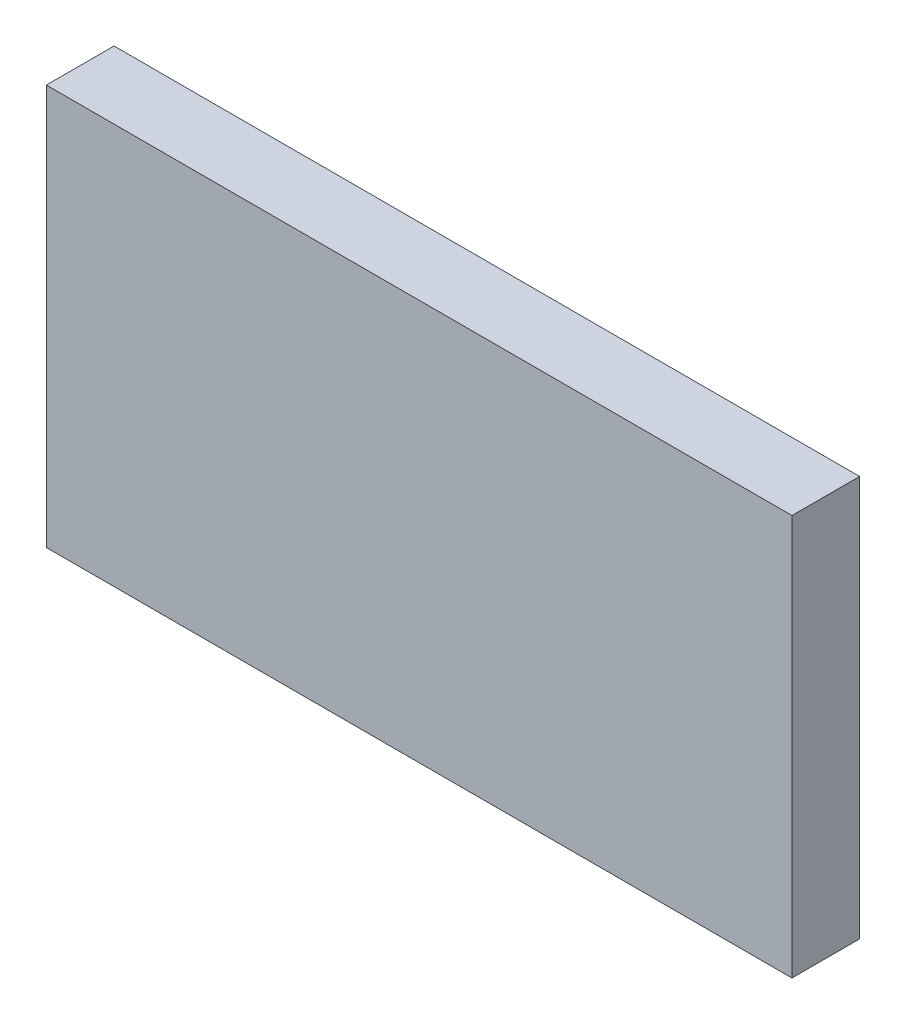
ISO-10303-21;
HEADER;
FILE_DESCRIPTION(('STEP AP214'),'2;1');
FILE_NAME('part.step','',(''),(''),'','','');
FILE_SCHEMA(('AUTOMOTIVE_DESIGN { 1 0 10303 214 1 1 1 1 }'));
ENDSEC;
DATA;
#1=APPLICATION_CONTEXT('core data for automotive mechanical design processes');
#2=APPLICATION_PROTOCOL_DEFINITION('international standard','automotive_design',2000,#1);
#3=PRODUCT_CONTEXT('',#1,'mechanical');
#4=PRODUCT('Part','Part','',(#3));
#5=PRODUCT_RELATED_PRODUCT_CATEGORY('part','',(#4));
#6=PRODUCT_DEFINITION_FORMATION('','',#4);
#7=PRODUCT_DEFINITION_CONTEXT('part definition',#1,'design');
#8=PRODUCT_DEFINITION('design','',#6,#7);
#9=PRODUCT_DEFINITION_SHAPE('','',#8);
#10=(LENGTH_UNIT() NAMED_UNIT(*) SI_UNIT(.MILLI.,.METRE.));
#11=(NAMED_UNIT(*) PLANE_ANGLE_UNIT() SI_UNIT($,.RADIAN.));
#12=(NAMED_UNIT(*) SI_UNIT($,.STERADIAN.) SOLID_ANGLE_UNIT());
#13=UNCERTAINTY_MEASURE_WITH_UNIT(LENGTH_MEASURE(1.E-05),#10,'distance_accuracy_value','');
#14=(GEOMETRIC_REPRESENTATION_CONTEXT(3) GLOBAL_UNCERTAINTY_ASSIGNED_CONTEXT((#13)) GLOBAL_UNIT_ASSIGNED_CONTEXT((#10,
#11,#12)) REPRESENTATION_CONTEXT('',''));
#15=CARTESIAN_POINT('',(0.,0.,0.));
#16=DIRECTION('',(0.,0.,1.));
#17=DIRECTION('',(1.,0.,0.));
#18=AXIS2_PLACEMENT_3D('',#15,#16,#17);
#19=CARTESIAN_POINT('',(-0.551,-2.221,0.));
#20=DIRECTION('',(1.,0.,0.));
#21=DIRECTION('',(0.,0.,1.));
#22=AXIS2_PLACEMENT_3D('',#19,#20,#21);
#23=PLANE('',#22);
#24=DIRECTION('',(0.,1.,0.));
#25=VECTOR('',#24,1.);
#26=CARTESIAN_POINT('',(-0.551,-2.221,0.1));
#27=LINE('',#26,#25);
#28=CARTESIAN_POINT('',(-0.551,-2.221,0.1));
#29=VERTEX_POINT('',#28);
#30=CARTESIAN_POINT('',(-0.551,-1.629,0.1));
#31=VERTEX_POINT('',#30);
#32=EDGE_CURVE('E11',#29,#31,#27,.T.);
#33=ORIENTED_EDGE('',*,*,#32,.T.);
#34=DIRECTION('',(0.,0.,1.));
#35=VECTOR('',#34,1.);
#36=CARTESIAN_POINT('',(-0.551,-1.629,0.));
#37=LINE('',#36,#35);
#38=CARTESIAN_POINT('',(-0.551,-1.629,0.));
#39=VERTEX_POINT('',#38);
#40=EDGE_CURVE('E24',#39,#31,#37,.T.);
#41=ORIENTED_EDGE('',*,*,#40,.F.);
#42=DIRECTION('',(0.,1.,0.));
#43=VECTOR('',#42,1.);
#44=CARTESIAN_POINT('',(-0.551,-2.221,0.));
#45=LINE('',#44,#43);
#46=CARTESIAN_POINT('',(-0.551,-2.221,0.));
#47=VERTEX_POINT('',#46);
#48=EDGE_CURVE('E86',#47,#39,#45,.T.);
#49=ORIENTED_EDGE('',*,*,#48,.F.);
#50=DIRECTION('',(0.,0.,1.));
#51=VECTOR('',#50,1.);
#52=CARTESIAN_POINT('',(-0.551,-2.221,0.));
#53=LINE('',#52,#51);
#54=EDGE_CURVE('E36',#47,#29,#53,.T.);
#55=ORIENTED_EDGE('',*,*,#54,.T.);
#56=EDGE_LOOP('',(#33,#41,#49,#55));
#57=FACE_BOUND('',#56,.T.);
#58=ADVANCED_FACE('F17',(#57),#23,.F.);
#59=CARTESIAN_POINT('',(0.551,-2.221,0.));
#60=DIRECTION('',(1.,0.,0.));
#61=DIRECTION('',(0.,0.,1.));
#62=AXIS2_PLACEMENT_3D('',#59,#60,#61);
#63=PLANE('',#62);
#64=DIRECTION('',(0.,0.,1.));
#65=VECTOR('',#64,1.);
#66=CARTESIAN_POINT('',(0.551,-2.221,0.));
#67=LINE('',#66,#65);
#68=CARTESIAN_POINT('',(0.551,-2.221,0.));
#69=VERTEX_POINT('',#68);
#70=CARTESIAN_POINT('',(0.551,-2.221,0.1));
#71=VERTEX_POINT('',#70);
#72=EDGE_CURVE('E83',#69,#71,#67,.T.);
#73=ORIENTED_EDGE('',*,*,#72,.F.);
#74=DIRECTION('',(0.,1.,0.));
#75=VECTOR('',#74,1.);
#76=CARTESIAN_POINT('',(0.551,-2.221,0.));
#77=LINE('',#76,#75);
#78=CARTESIAN_POINT('',(0.551,-1.629,0.));
#79=VERTEX_POINT('',#78);
#80=EDGE_CURVE('E63',#69,#79,#77,.T.);
#81=ORIENTED_EDGE('',*,*,#80,.T.);
#82=DIRECTION('',(0.,0.,1.));
#83=VECTOR('',#82,1.);
#84=CARTESIAN_POINT('',(0.551,-1.629,0.));
#85=LINE('',#84,#83);
#86=CARTESIAN_POINT('',(0.551,-1.629,0.1));
#87=VERTEX_POINT('',#86);
#88=EDGE_CURVE('E57',#79,#87,#85,.T.);
#89=ORIENTED_EDGE('',*,*,#88,.T.);
#90=DIRECTION('',(0.,1.,0.));
#91=VECTOR('',#90,1.);
#92=CARTESIAN_POINT('',(0.551,-2.221,0.1));
#93=LINE('',#92,#91);
#94=EDGE_CURVE('E60',#71,#87,#93,.T.);
#95=ORIENTED_EDGE('',*,*,#94,.F.);
#96=EDGE_LOOP('',(#73,#81,#89,#95));
#97=FACE_BOUND('',#96,.T.);
#98=ADVANCED_FACE('F59',(#97),#63,.T.);
#99=CARTESIAN_POINT('',(-0.551,-2.221,0.));
#100=DIRECTION('',(0.,1.,0.));
#101=DIRECTION('',(0.,0.,1.));
#102=AXIS2_PLACEMENT_3D('',#99,#100,#101);
#103=PLANE('',#102);
#104=ORIENTED_EDGE('',*,*,#72,.T.);
#105=DIRECTION('',(1.,0.,0.));
#106=VECTOR('',#105,1.);
#107=CARTESIAN_POINT('',(-0.551,-2.221,0.1));
#108=LINE('',#107,#106);
#109=EDGE_CURVE('E71',#29,#71,#108,.T.);
#110=ORIENTED_EDGE('',*,*,#109,.F.);
#111=ORIENTED_EDGE('',*,*,#54,.F.);
#112=DIRECTION('',(1.,0.,0.));
#113=VECTOR('',#112,1.);
#114=CARTESIAN_POINT('',(-0.551,-2.221,0.));
#115=LINE('',#114,#113);
#116=EDGE_CURVE('E76',#47,#69,#115,.T.);
#117=ORIENTED_EDGE('',*,*,#116,.T.);
#118=EDGE_LOOP('',(#104,#110,#111,#117));
#119=FACE_BOUND('',#118,.T.);
#120=ADVANCED_FACE('F91',(#119),#103,.F.);
#121=CARTESIAN_POINT('',(-0.551,-1.629,0.));
#122=DIRECTION('',(0.,1.,0.));
#123=DIRECTION('',(0.,0.,1.));
#124=AXIS2_PLACEMENT_3D('',#121,#122,#123);
#125=PLANE('',#124);
#126=DIRECTION('',(1.,0.,0.));
#127=VECTOR('',#126,1.);
#128=CARTESIAN_POINT('',(-0.551,-1.629,0.));
#129=LINE('',#128,#127);
#130=EDGE_CURVE('E74',#39,#79,#129,.T.);
#131=ORIENTED_EDGE('',*,*,#130,.F.);
#132=ORIENTED_EDGE('',*,*,#40,.T.);
#133=DIRECTION('',(1.,0.,0.));
#134=VECTOR('',#133,1.);
#135=CARTESIAN_POINT('',(-0.551,-1.629,0.1));
#136=LINE('',#135,#134);
#137=EDGE_CURVE('E69',#31,#87,#136,.T.);
#138=ORIENTED_EDGE('',*,*,#137,.T.);
#139=ORIENTED_EDGE('',*,*,#88,.F.);
#140=EDGE_LOOP('',(#131,#132,#138,#139));
#141=FACE_BOUND('',#140,.T.);
#142=ADVANCED_FACE('F73',(#141),#125,.T.);
#143=CARTESIAN_POINT('',(-0.551,-2.221,0.));
#144=DIRECTION('',(0.,0.,1.));
#145=DIRECTION('',(1.,0.,0.));
#146=AXIS2_PLACEMENT_3D('',#143,#144,#145);
#147=PLANE('',#146);
#148=ORIENTED_EDGE('',*,*,#130,.T.);
#149=ORIENTED_EDGE('',*,*,#80,.F.);
#150=ORIENTED_EDGE('',*,*,#116,.F.);
#151=ORIENTED_EDGE('',*,*,#48,.T.);
#152=EDGE_LOOP('',(#148,#149,#150,#151));
#153=FACE_BOUND('',#152,.T.);
#154=ADVANCED_FACE('F89',(#153),#147,.F.);
#155=CARTESIAN_POINT('',(-0.551,-2.221,0.1));
#156=DIRECTION('',(0.,0.,1.));
#157=DIRECTION('',(1.,0.,0.));
#158=AXIS2_PLACEMENT_3D('',#155,#156,#157);
#159=PLANE('',#158);
#160=ORIENTED_EDGE('',*,*,#32,.F.);
#161=ORIENTED_EDGE('',*,*,#109,.T.);
#162=ORIENTED_EDGE('',*,*,#94,.T.);
#163=ORIENTED_EDGE('',*,*,#137,.F.);
#164=EDGE_LOOP('',(#160,#161,#162,#163));
#165=FACE_BOUND('',#164,.T.);
#166=ADVANCED_FACE('F68',(#165),#159,.T.);
#167=CLOSED_SHELL('',(#58,#98,#120,#142,#154,#166));
#168=MANIFOLD_SOLID_BREP('B1',#167);
#169=ADVANCED_BREP_SHAPE_REPRESENTATION('',(#18,#168),#14);
#170=SHAPE_DEFINITION_REPRESENTATION(#9,#169);
ENDSEC;
END-ISO-10303-21;
